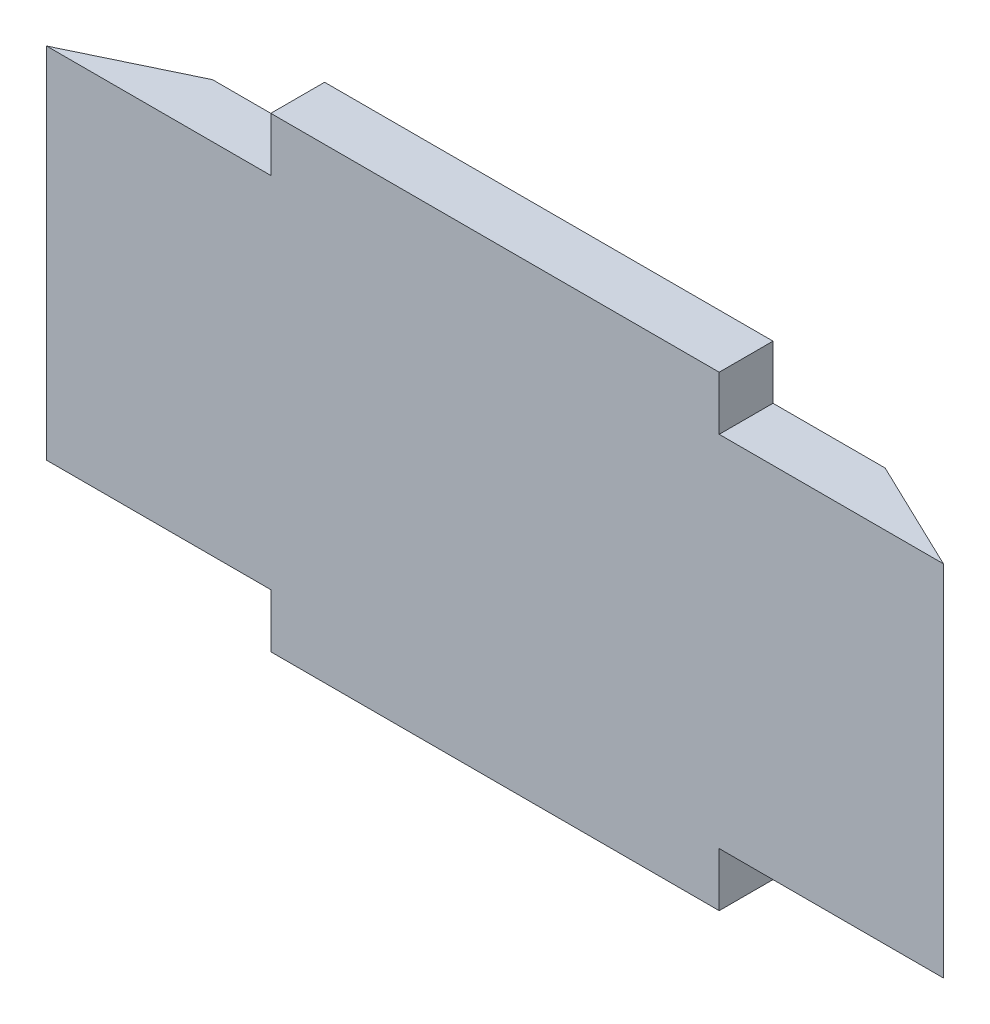
ISO-10303-21;
HEADER;
FILE_DESCRIPTION(('STEP AP214'),'2;1');
FILE_NAME('part.step','',(''),(''),'','','');
FILE_SCHEMA(('AUTOMOTIVE_DESIGN { 1 0 10303 214 1 1 1 1 }'));
ENDSEC;
DATA;
#1=APPLICATION_CONTEXT('core data for automotive mechanical design processes');
#2=APPLICATION_PROTOCOL_DEFINITION('international standard','automotive_design',2000,#1);
#3=PRODUCT_CONTEXT('',#1,'mechanical');
#4=PRODUCT('Part','Part','',(#3));
#5=PRODUCT_RELATED_PRODUCT_CATEGORY('part','',(#4));
#6=PRODUCT_DEFINITION_FORMATION('','',#4);
#7=PRODUCT_DEFINITION_CONTEXT('part definition',#1,'design');
#8=PRODUCT_DEFINITION('design','',#6,#7);
#9=PRODUCT_DEFINITION_SHAPE('','',#8);
#10=(LENGTH_UNIT() NAMED_UNIT(*) SI_UNIT(.MILLI.,.METRE.));
#11=(NAMED_UNIT(*) PLANE_ANGLE_UNIT() SI_UNIT($,.RADIAN.));
#12=(NAMED_UNIT(*) SI_UNIT($,.STERADIAN.) SOLID_ANGLE_UNIT());
#13=UNCERTAINTY_MEASURE_WITH_UNIT(LENGTH_MEASURE(1.E-05),#10,'distance_accuracy_value','');
#14=(GEOMETRIC_REPRESENTATION_CONTEXT(3) GLOBAL_UNCERTAINTY_ASSIGNED_CONTEXT((#13)) GLOBAL_UNIT_ASSIGNED_CONTEXT((#10,
#11,#12)) REPRESENTATION_CONTEXT('',''));
#15=CARTESIAN_POINT('',(0.,0.,0.));
#16=DIRECTION('',(0.,0.,1.));
#17=DIRECTION('',(1.,0.,0.));
#18=AXIS2_PLACEMENT_3D('',#15,#16,#17);
#19=CARTESIAN_POINT('',(50.,-20.,6.));
#20=DIRECTION('',(0.,1.,0.));
#21=DIRECTION('',(-1.,0.,0.));
#22=AXIS2_PLACEMENT_3D('',#19,#20,#21);
#23=PLANE('',#22);
#24=DIRECTION('',(1.,0.,0.));
#25=VECTOR('',#24,1.);
#26=CARTESIAN_POINT('',(50.,-20.,0.));
#27=LINE('',#26,#25);
#28=CARTESIAN_POINT('',(25.,-20.,0.));
#29=VERTEX_POINT('',#28);
#30=CARTESIAN_POINT('',(37.5,-20.,0.));
#31=VERTEX_POINT('',#30);
#32=EDGE_CURVE('E157',#29,#31,#27,.T.);
#33=ORIENTED_EDGE('',*,*,#32,.T.);
#34=DIRECTION('',(0.901523057468274,0.,0.43273106758477));
#35=VECTOR('',#34,1.);
#36=CARTESIAN_POINT('',(50.,-20.,6.));
#37=LINE('',#36,#35);
#38=CARTESIAN_POINT('',(50.,-20.,6.));
#39=VERTEX_POINT('',#38);
#40=EDGE_CURVE('E49',#31,#39,#37,.T.);
#41=ORIENTED_EDGE('',*,*,#40,.T.);
#42=DIRECTION('',(1.,0.,0.));
#43=VECTOR('',#42,1.);
#44=CARTESIAN_POINT('',(50.,-20.,6.));
#45=LINE('',#44,#43);
#46=CARTESIAN_POINT('',(25.,-20.,6.));
#47=VERTEX_POINT('',#46);
#48=EDGE_CURVE('E128',#47,#39,#45,.T.);
#49=ORIENTED_EDGE('',*,*,#48,.F.);
#50=DIRECTION('',(0.,0.,1.));
#51=VECTOR('',#50,1.);
#52=CARTESIAN_POINT('',(25.,-20.,0.));
#53=LINE('',#52,#51);
#54=EDGE_CURVE('E208',#29,#47,#53,.T.);
#55=ORIENTED_EDGE('',*,*,#54,.F.);
#56=EDGE_LOOP('',(#33,#41,#49,#55));
#57=FACE_BOUND('',#56,.T.);
#58=ADVANCED_FACE('F34',(#57),#23,.F.);
#59=CARTESIAN_POINT('',(50.,20.,6.));
#60=DIRECTION('',(0.,-1.,0.));
#61=DIRECTION('',(1.,0.,0.));
#62=AXIS2_PLACEMENT_3D('',#59,#60,#61);
#63=PLANE('',#62);
#64=DIRECTION('',(-1.,0.,0.));
#65=VECTOR('',#64,1.);
#66=CARTESIAN_POINT('',(50.,20.,0.));
#67=LINE('',#66,#65);
#68=CARTESIAN_POINT('',(-25.,20.,0.));
#69=VERTEX_POINT('',#68);
#70=CARTESIAN_POINT('',(-37.5,20.,0.));
#71=VERTEX_POINT('',#70);
#72=EDGE_CURVE('E138',#69,#71,#67,.T.);
#73=ORIENTED_EDGE('',*,*,#72,.T.);
#74=DIRECTION('',(0.901523057468273,0.,-0.432731067584772));
#75=VECTOR('',#74,1.);
#76=CARTESIAN_POINT('',(-50.,20.,6.));
#77=LINE('',#76,#75);
#78=CARTESIAN_POINT('',(-50.,20.,6.));
#79=VERTEX_POINT('',#78);
#80=EDGE_CURVE('E56',#79,#71,#77,.T.);
#81=ORIENTED_EDGE('',*,*,#80,.F.);
#82=DIRECTION('',(-1.,0.,0.));
#83=VECTOR('',#82,1.);
#84=CARTESIAN_POINT('',(50.,20.,6.));
#85=LINE('',#84,#83);
#86=CARTESIAN_POINT('',(-25.,20.,6.));
#87=VERTEX_POINT('',#86);
#88=EDGE_CURVE('E136',#87,#79,#85,.T.);
#89=ORIENTED_EDGE('',*,*,#88,.F.);
#90=DIRECTION('',(0.,0.,1.));
#91=VECTOR('',#90,1.);
#92=CARTESIAN_POINT('',(-25.,20.,0.));
#93=LINE('',#92,#91);
#94=EDGE_CURVE('E181',#69,#87,#93,.T.);
#95=ORIENTED_EDGE('',*,*,#94,.F.);
#96=EDGE_LOOP('',(#73,#81,#89,#95));
#97=FACE_BOUND('',#96,.T.);
#98=ADVANCED_FACE('F134',(#97),#63,.F.);
#99=CARTESIAN_POINT('',(-50.,-20.,6.));
#100=VERTEX_POINT('',#99);
#101=CARTESIAN_POINT('',(-25.,-20.,6.));
#102=VERTEX_POINT('',#101);
#103=EDGE_CURVE('E151',#100,#102,#45,.T.);
#104=ORIENTED_EDGE('',*,*,#103,.F.);
#105=DIRECTION('',(0.901523057468273,0.,-0.432731067584772));
#106=VECTOR('',#105,1.);
#107=CARTESIAN_POINT('',(31.2743823146944,-20.,-33.0117035110534));
#108=LINE('',#107,#106);
#109=CARTESIAN_POINT('',(-37.5,-20.,0.));
#110=VERTEX_POINT('',#109);
#111=EDGE_CURVE('E123',#100,#110,#108,.T.);
#112=ORIENTED_EDGE('',*,*,#111,.T.);
#113=CARTESIAN_POINT('',(-25.,-20.,0.));
#114=VERTEX_POINT('',#113);
#115=EDGE_CURVE('E155',#110,#114,#27,.T.);
#116=ORIENTED_EDGE('',*,*,#115,.T.);
#117=DIRECTION('',(0.,0.,1.));
#118=VECTOR('',#117,1.);
#119=CARTESIAN_POINT('',(-25.,-20.,0.));
#120=LINE('',#119,#118);
#121=EDGE_CURVE('E189',#114,#102,#120,.T.);
#122=ORIENTED_EDGE('',*,*,#121,.T.);
#123=EDGE_LOOP('',(#104,#112,#116,#122));
#124=FACE_BOUND('',#123,.T.);
#125=ADVANCED_FACE('F36',(#124),#23,.F.);
#126=CARTESIAN_POINT('',(50.,20.,6.));
#127=VERTEX_POINT('',#126);
#128=CARTESIAN_POINT('',(25.,20.,6.));
#129=VERTEX_POINT('',#128);
#130=EDGE_CURVE('E146',#127,#129,#85,.T.);
#131=ORIENTED_EDGE('',*,*,#130,.F.);
#132=DIRECTION('',(0.901523057468274,0.,0.43273106758477));
#133=VECTOR('',#132,1.);
#134=CARTESIAN_POINT('',(50.,20.,6.));
#135=LINE('',#134,#133);
#136=CARTESIAN_POINT('',(37.5,20.,0.));
#137=VERTEX_POINT('',#136);
#138=EDGE_CURVE('E139',#137,#127,#135,.T.);
#139=ORIENTED_EDGE('',*,*,#138,.F.);
#140=CARTESIAN_POINT('',(25.,20.,0.));
#141=VERTEX_POINT('',#140);
#142=EDGE_CURVE('E129',#137,#141,#67,.T.);
#143=ORIENTED_EDGE('',*,*,#142,.T.);
#144=DIRECTION('',(0.,0.,1.));
#145=VECTOR('',#144,1.);
#146=CARTESIAN_POINT('',(25.,20.,0.));
#147=LINE('',#146,#145);
#148=EDGE_CURVE('E197',#141,#129,#147,.T.);
#149=ORIENTED_EDGE('',*,*,#148,.T.);
#150=EDGE_LOOP('',(#131,#139,#143,#149));
#151=FACE_BOUND('',#150,.T.);
#152=ADVANCED_FACE('F166',(#151),#63,.F.);
#153=CARTESIAN_POINT('',(0.,0.,6.));
#154=DIRECTION('',(0.,0.,-1.));
#155=DIRECTION('',(-1.,0.,0.));
#156=AXIS2_PLACEMENT_3D('',#153,#154,#155);
#157=PLANE('',#156);
#158=DIRECTION('',(0.,-1.,0.));
#159=VECTOR('',#158,1.);
#160=CARTESIAN_POINT('',(-50.,20.,6.));
#161=LINE('',#160,#159);
#162=EDGE_CURVE('E120',#79,#100,#161,.T.);
#163=ORIENTED_EDGE('',*,*,#162,.T.);
#164=ORIENTED_EDGE('',*,*,#103,.T.);
#165=DIRECTION('',(0.,-1.,0.));
#166=VECTOR('',#165,1.);
#167=CARTESIAN_POINT('',(-25.,-20.,6.));
#168=LINE('',#167,#166);
#169=CARTESIAN_POINT('',(-25.,-26.,6.));
#170=VERTEX_POINT('',#169);
#171=EDGE_CURVE('E210',#102,#170,#168,.T.);
#172=ORIENTED_EDGE('',*,*,#171,.T.);
#173=DIRECTION('',(1.,0.,0.));
#174=VECTOR('',#173,1.);
#175=CARTESIAN_POINT('',(-25.,-26.,6.));
#176=LINE('',#175,#174);
#177=CARTESIAN_POINT('',(25.,-26.,6.));
#178=VERTEX_POINT('',#177);
#179=EDGE_CURVE('E223',#170,#178,#176,.T.);
#180=ORIENTED_EDGE('',*,*,#179,.T.);
#181=DIRECTION('',(0.,1.,0.));
#182=VECTOR('',#181,1.);
#183=CARTESIAN_POINT('',(25.,-20.,6.));
#184=LINE('',#183,#182);
#185=EDGE_CURVE('E205',#178,#47,#184,.T.);
#186=ORIENTED_EDGE('',*,*,#185,.T.);
#187=ORIENTED_EDGE('',*,*,#48,.T.);
#188=DIRECTION('',(0.,1.,0.));
#189=VECTOR('',#188,1.);
#190=CARTESIAN_POINT('',(50.,20.,6.));
#191=LINE('',#190,#189);
#192=EDGE_CURVE('E147',#39,#127,#191,.T.);
#193=ORIENTED_EDGE('',*,*,#192,.T.);
#194=ORIENTED_EDGE('',*,*,#130,.T.);
#195=DIRECTION('',(0.,1.,0.));
#196=VECTOR('',#195,1.);
#197=CARTESIAN_POINT('',(25.,20.,6.));
#198=LINE('',#197,#196);
#199=CARTESIAN_POINT('',(25.,26.,6.));
#200=VERTEX_POINT('',#199);
#201=EDGE_CURVE('E188',#129,#200,#198,.T.);
#202=ORIENTED_EDGE('',*,*,#201,.T.);
#203=DIRECTION('',(-1.,0.,0.));
#204=VECTOR('',#203,1.);
#205=CARTESIAN_POINT('',(-25.,26.,6.));
#206=LINE('',#205,#204);
#207=CARTESIAN_POINT('',(-25.,26.,6.));
#208=VERTEX_POINT('',#207);
#209=EDGE_CURVE('E183',#200,#208,#206,.T.);
#210=ORIENTED_EDGE('',*,*,#209,.T.);
#211=DIRECTION('',(0.,-1.,0.));
#212=VECTOR('',#211,1.);
#213=CARTESIAN_POINT('',(-25.,20.,6.));
#214=LINE('',#213,#212);
#215=EDGE_CURVE('E145',#208,#87,#214,.T.);
#216=ORIENTED_EDGE('',*,*,#215,.T.);
#217=ORIENTED_EDGE('',*,*,#88,.T.);
#218=EDGE_LOOP('',(#163,#164,#172,#180,#186,#187,#193,#194,#202,#210,#216,#217));
#219=FACE_BOUND('',#218,.T.);
#220=ADVANCED_FACE('F142',(#219),#157,.F.);
#221=CARTESIAN_POINT('',(0.,0.,0.));
#222=DIRECTION('',(0.,0.,-1.));
#223=DIRECTION('',(-1.,0.,0.));
#224=AXIS2_PLACEMENT_3D('',#221,#222,#223);
#225=PLANE('',#224);
#226=DIRECTION('',(0.,-1.,0.));
#227=VECTOR('',#226,1.);
#228=CARTESIAN_POINT('',(-37.5,0.,0.));
#229=LINE('',#228,#227);
#230=EDGE_CURVE('E11',#71,#110,#229,.T.);
#231=ORIENTED_EDGE('',*,*,#230,.F.);
#232=ORIENTED_EDGE('',*,*,#72,.F.);
#233=DIRECTION('',(0.,-1.,0.));
#234=VECTOR('',#233,1.);
#235=CARTESIAN_POINT('',(-25.,20.,0.));
#236=LINE('',#235,#234);
#237=CARTESIAN_POINT('',(-25.,26.,0.));
#238=VERTEX_POINT('',#237);
#239=EDGE_CURVE('E179',#238,#69,#236,.T.);
#240=ORIENTED_EDGE('',*,*,#239,.F.);
#241=DIRECTION('',(-1.,0.,0.));
#242=VECTOR('',#241,1.);
#243=CARTESIAN_POINT('',(-25.,26.,0.));
#244=LINE('',#243,#242);
#245=CARTESIAN_POINT('',(25.,26.,0.));
#246=VERTEX_POINT('',#245);
#247=EDGE_CURVE('E177',#246,#238,#244,.T.);
#248=ORIENTED_EDGE('',*,*,#247,.F.);
#249=DIRECTION('',(0.,1.,0.));
#250=VECTOR('',#249,1.);
#251=CARTESIAN_POINT('',(25.,20.,0.));
#252=LINE('',#251,#250);
#253=EDGE_CURVE('E174',#141,#246,#252,.T.);
#254=ORIENTED_EDGE('',*,*,#253,.F.);
#255=ORIENTED_EDGE('',*,*,#142,.F.);
#256=DIRECTION('',(0.,1.,0.));
#257=VECTOR('',#256,1.);
#258=CARTESIAN_POINT('',(37.5,0.,0.));
#259=LINE('',#258,#257);
#260=EDGE_CURVE('E42',#31,#137,#259,.T.);
#261=ORIENTED_EDGE('',*,*,#260,.F.);
#262=ORIENTED_EDGE('',*,*,#32,.F.);
#263=DIRECTION('',(0.,1.,0.));
#264=VECTOR('',#263,1.);
#265=CARTESIAN_POINT('',(25.,-20.,0.));
#266=LINE('',#265,#264);
#267=CARTESIAN_POINT('',(25.,-26.,0.));
#268=VERTEX_POINT('',#267);
#269=EDGE_CURVE('E219',#268,#29,#266,.T.);
#270=ORIENTED_EDGE('',*,*,#269,.F.);
#271=DIRECTION('',(1.,0.,0.));
#272=VECTOR('',#271,1.);
#273=CARTESIAN_POINT('',(-25.,-26.,0.));
#274=LINE('',#273,#272);
#275=CARTESIAN_POINT('',(-25.,-26.,0.));
#276=VERTEX_POINT('',#275);
#277=EDGE_CURVE('E216',#276,#268,#274,.T.);
#278=ORIENTED_EDGE('',*,*,#277,.F.);
#279=DIRECTION('',(0.,-1.,0.));
#280=VECTOR('',#279,1.);
#281=CARTESIAN_POINT('',(-25.,-20.,0.));
#282=LINE('',#281,#280);
#283=EDGE_CURVE('E213',#114,#276,#282,.T.);
#284=ORIENTED_EDGE('',*,*,#283,.F.);
#285=ORIENTED_EDGE('',*,*,#115,.F.);
#286=EDGE_LOOP('',(#231,#232,#240,#248,#254,#255,#261,#262,#270,#278,#284,#285));
#287=FACE_BOUND('',#286,.T.);
#288=ADVANCED_FACE('F171',(#287),#225,.T.);
#289=CARTESIAN_POINT('',(-25.,20.,0.));
#290=DIRECTION('',(-1.,0.,0.));
#291=DIRECTION('',(0.,-1.,0.));
#292=AXIS2_PLACEMENT_3D('',#289,#290,#291);
#293=PLANE('',#292);
#294=ORIENTED_EDGE('',*,*,#215,.F.);
#295=DIRECTION('',(0.,0.,1.));
#296=VECTOR('',#295,1.);
#297=CARTESIAN_POINT('',(-25.,26.,0.));
#298=LINE('',#297,#296);
#299=EDGE_CURVE('E193',#238,#208,#298,.T.);
#300=ORIENTED_EDGE('',*,*,#299,.F.);
#301=ORIENTED_EDGE('',*,*,#239,.T.);
#302=ORIENTED_EDGE('',*,*,#94,.T.);
#303=EDGE_LOOP('',(#294,#300,#301,#302));
#304=FACE_BOUND('',#303,.T.);
#305=ADVANCED_FACE('F287',(#304),#293,.T.);
#306=CARTESIAN_POINT('',(-25.,26.,0.));
#307=DIRECTION('',(0.,1.,0.));
#308=DIRECTION('',(0.,0.,1.));
#309=AXIS2_PLACEMENT_3D('',#306,#307,#308);
#310=PLANE('',#309);
#311=ORIENTED_EDGE('',*,*,#209,.F.);
#312=DIRECTION('',(0.,0.,1.));
#313=VECTOR('',#312,1.);
#314=CARTESIAN_POINT('',(25.,26.,0.));
#315=LINE('',#314,#313);
#316=EDGE_CURVE('E195',#246,#200,#315,.T.);
#317=ORIENTED_EDGE('',*,*,#316,.F.);
#318=ORIENTED_EDGE('',*,*,#247,.T.);
#319=ORIENTED_EDGE('',*,*,#299,.T.);
#320=EDGE_LOOP('',(#311,#317,#318,#319));
#321=FACE_BOUND('',#320,.T.);
#322=ADVANCED_FACE('F318',(#321),#310,.T.);
#323=CARTESIAN_POINT('',(25.,20.,0.));
#324=DIRECTION('',(1.,0.,0.));
#325=DIRECTION('',(0.,1.,0.));
#326=AXIS2_PLACEMENT_3D('',#323,#324,#325);
#327=PLANE('',#326);
#328=ORIENTED_EDGE('',*,*,#201,.F.);
#329=ORIENTED_EDGE('',*,*,#148,.F.);
#330=ORIENTED_EDGE('',*,*,#253,.T.);
#331=ORIENTED_EDGE('',*,*,#316,.T.);
#332=EDGE_LOOP('',(#328,#329,#330,#331));
#333=FACE_BOUND('',#332,.T.);
#334=ADVANCED_FACE('F317',(#333),#327,.T.);
#335=CARTESIAN_POINT('',(-25.,-20.,0.));
#336=DIRECTION('',(-1.,0.,0.));
#337=DIRECTION('',(0.,-1.,0.));
#338=AXIS2_PLACEMENT_3D('',#335,#336,#337);
#339=PLANE('',#338);
#340=ORIENTED_EDGE('',*,*,#171,.F.);
#341=ORIENTED_EDGE('',*,*,#121,.F.);
#342=ORIENTED_EDGE('',*,*,#283,.T.);
#343=DIRECTION('',(0.,0.,1.));
#344=VECTOR('',#343,1.);
#345=CARTESIAN_POINT('',(-25.,-26.,0.));
#346=LINE('',#345,#344);
#347=EDGE_CURVE('E221',#276,#170,#346,.T.);
#348=ORIENTED_EDGE('',*,*,#347,.T.);
#349=EDGE_LOOP('',(#340,#341,#342,#348));
#350=FACE_BOUND('',#349,.T.);
#351=ADVANCED_FACE('F232',(#350),#339,.T.);
#352=CARTESIAN_POINT('',(25.,-20.,0.));
#353=DIRECTION('',(1.,0.,0.));
#354=DIRECTION('',(0.,1.,0.));
#355=AXIS2_PLACEMENT_3D('',#352,#353,#354);
#356=PLANE('',#355);
#357=ORIENTED_EDGE('',*,*,#185,.F.);
#358=DIRECTION('',(0.,0.,1.));
#359=VECTOR('',#358,1.);
#360=CARTESIAN_POINT('',(25.,-26.,0.));
#361=LINE('',#360,#359);
#362=EDGE_CURVE('E229',#268,#178,#361,.T.);
#363=ORIENTED_EDGE('',*,*,#362,.F.);
#364=ORIENTED_EDGE('',*,*,#269,.T.);
#365=ORIENTED_EDGE('',*,*,#54,.T.);
#366=EDGE_LOOP('',(#357,#363,#364,#365));
#367=FACE_BOUND('',#366,.T.);
#368=ADVANCED_FACE('F240',(#367),#356,.T.);
#369=CARTESIAN_POINT('',(-25.,-26.,0.));
#370=DIRECTION('',(0.,-1.,0.));
#371=DIRECTION('',(0.,0.,-1.));
#372=AXIS2_PLACEMENT_3D('',#369,#370,#371);
#373=PLANE('',#372);
#374=ORIENTED_EDGE('',*,*,#179,.F.);
#375=ORIENTED_EDGE('',*,*,#347,.F.);
#376=ORIENTED_EDGE('',*,*,#277,.T.);
#377=ORIENTED_EDGE('',*,*,#362,.T.);
#378=EDGE_LOOP('',(#374,#375,#376,#377));
#379=FACE_BOUND('',#378,.T.);
#380=ADVANCED_FACE('F237',(#379),#373,.T.);
#381=CARTESIAN_POINT('',(50.,-26.,6.));
#382=DIRECTION('',(-0.43273106758477,0.,0.901523057468274));
#383=DIRECTION('',(0.901523057468274,0.,0.43273106758477));
#384=AXIS2_PLACEMENT_3D('',#381,#382,#383);
#385=PLANE('',#384);
#386=ORIENTED_EDGE('',*,*,#260,.T.);
#387=ORIENTED_EDGE('',*,*,#138,.T.);
#388=ORIENTED_EDGE('',*,*,#192,.F.);
#389=ORIENTED_EDGE('',*,*,#40,.F.);
#390=EDGE_LOOP('',(#386,#387,#388,#389));
#391=FACE_BOUND('',#390,.T.);
#392=ADVANCED_FACE('F159',(#391),#385,.F.);
#393=CARTESIAN_POINT('',(-50.,-26.,6.));
#394=DIRECTION('',(0.432731067584772,0.,0.901523057468273));
#395=DIRECTION('',(0.901523057468273,0.,-0.432731067584772));
#396=AXIS2_PLACEMENT_3D('',#393,#394,#395);
#397=PLANE('',#396);
#398=ORIENTED_EDGE('',*,*,#162,.F.);
#399=ORIENTED_EDGE('',*,*,#80,.T.);
#400=ORIENTED_EDGE('',*,*,#230,.T.);
#401=ORIENTED_EDGE('',*,*,#111,.F.);
#402=EDGE_LOOP('',(#398,#399,#400,#401));
#403=FACE_BOUND('',#402,.T.);
#404=ADVANCED_FACE('F121',(#403),#397,.F.);
#405=CLOSED_SHELL('',(#58,#98,#125,#152,#220,#288,#305,#322,#334,#351,#368,#380,#392,#404));
#406=MANIFOLD_SOLID_BREP('B2',#405);
#407=ADVANCED_BREP_SHAPE_REPRESENTATION('',(#18,#406),#14);
#408=SHAPE_DEFINITION_REPRESENTATION(#9,#407);
ENDSEC;
END-ISO-10303-21;
